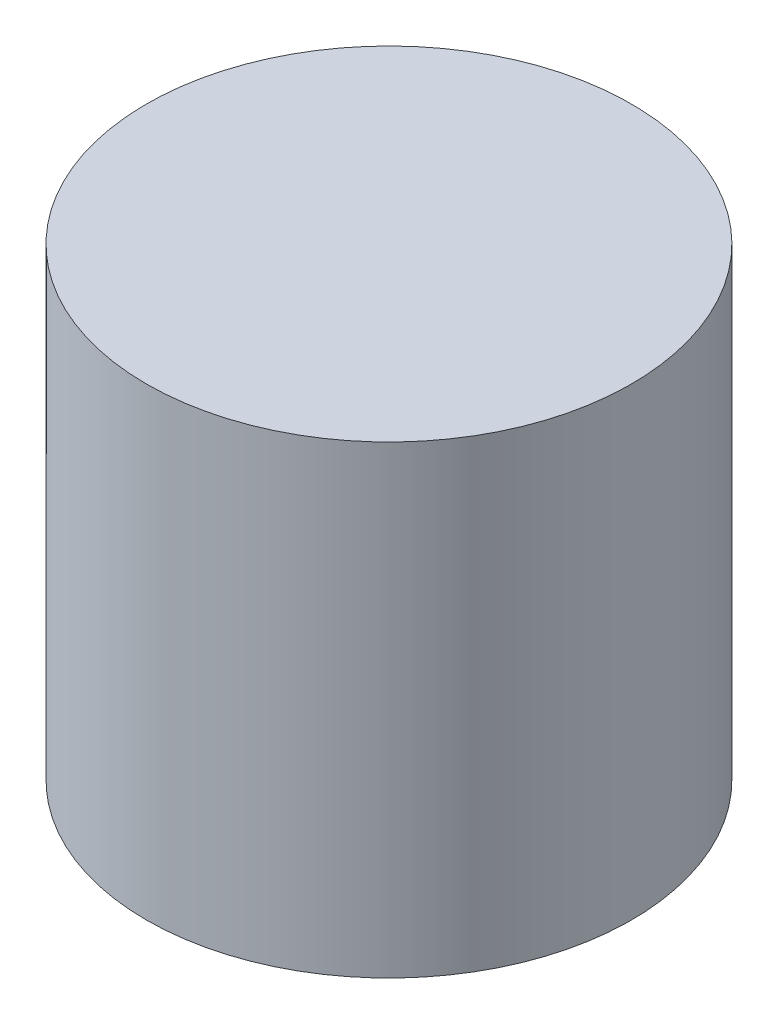
ISO-10303-21;
HEADER;
FILE_DESCRIPTION(('STEP AP214'),'2;1');
FILE_NAME('part.step','',(''),(''),'','','');
FILE_SCHEMA(('AUTOMOTIVE_DESIGN { 1 0 10303 214 1 1 1 1 }'));
ENDSEC;
DATA;
#1=APPLICATION_CONTEXT('core data for automotive mechanical design processes');
#2=APPLICATION_PROTOCOL_DEFINITION('international standard','automotive_design',2000,#1);
#3=PRODUCT_CONTEXT('',#1,'mechanical');
#4=PRODUCT('Part','Part','',(#3));
#5=PRODUCT_RELATED_PRODUCT_CATEGORY('part','',(#4));
#6=PRODUCT_DEFINITION_FORMATION('','',#4);
#7=PRODUCT_DEFINITION_CONTEXT('part definition',#1,'design');
#8=PRODUCT_DEFINITION('design','',#6,#7);
#9=PRODUCT_DEFINITION_SHAPE('','',#8);
#10=(LENGTH_UNIT() NAMED_UNIT(*) SI_UNIT(.MILLI.,.METRE.));
#11=(NAMED_UNIT(*) PLANE_ANGLE_UNIT() SI_UNIT($,.RADIAN.));
#12=(NAMED_UNIT(*) SI_UNIT($,.STERADIAN.) SOLID_ANGLE_UNIT());
#13=UNCERTAINTY_MEASURE_WITH_UNIT(LENGTH_MEASURE(1.E-05),#10,'distance_accuracy_value','');
#14=(GEOMETRIC_REPRESENTATION_CONTEXT(3) GLOBAL_UNCERTAINTY_ASSIGNED_CONTEXT((#13)) GLOBAL_UNIT_ASSIGNED_CONTEXT((#10,
#11,#12)) REPRESENTATION_CONTEXT('',''));
#15=CARTESIAN_POINT('',(0.,0.,0.));
#16=DIRECTION('',(0.,0.,1.));
#17=DIRECTION('',(1.,0.,0.));
#18=AXIS2_PLACEMENT_3D('',#15,#16,#17);
#19=CARTESIAN_POINT('',(0.,85.09,0.));
#20=DIRECTION('',(0.,-1.,0.));
#21=DIRECTION('',(0.,0.,-1.));
#22=AXIS2_PLACEMENT_3D('',#19,#20,#21);
#23=CYLINDRICAL_SURFACE('',#22,44.45);
#24=CARTESIAN_POINT('',(0.,85.09,0.));
#25=DIRECTION('',(0.,1.,0.));
#26=DIRECTION('',(0.,0.,1.));
#27=AXIS2_PLACEMENT_3D('',#24,#25,#26);
#28=CIRCLE('',#27,44.45);
#29=CARTESIAN_POINT('',(0.,85.09,44.45));
#30=VERTEX_POINT('',#29);
#31=EDGE_CURVE('E10',#30,#30,#28,.T.);
#32=ORIENTED_EDGE('',*,*,#31,.F.);
#33=EDGE_LOOP('',(#32));
#34=FACE_BOUND('',#33,.T.);
#35=CARTESIAN_POINT('',(0.,0.,0.));
#36=DIRECTION('',(0.,1.,0.));
#37=DIRECTION('',(0.,0.,1.));
#38=AXIS2_PLACEMENT_3D('',#35,#36,#37);
#39=CIRCLE('',#38,44.45);
#40=CARTESIAN_POINT('',(0.,0.,44.45));
#41=VERTEX_POINT('',#40);
#42=EDGE_CURVE('E35',#41,#41,#39,.T.);
#43=ORIENTED_EDGE('',*,*,#42,.T.);
#44=EDGE_LOOP('',(#43));
#45=FACE_BOUND('',#44,.T.);
#46=ADVANCED_FACE('F29',(#34,#45),#23,.T.);
#47=CARTESIAN_POINT('',(0.,85.09,0.));
#48=DIRECTION('',(0.,1.,0.));
#49=DIRECTION('',(0.,0.,1.));
#50=AXIS2_PLACEMENT_3D('',#47,#48,#49);
#51=PLANE('',#50);
#52=ORIENTED_EDGE('',*,*,#31,.T.);
#53=EDGE_LOOP('',(#52));
#54=FACE_BOUND('',#53,.T.);
#55=ADVANCED_FACE('F44',(#54),#51,.T.);
#56=CARTESIAN_POINT('',(0.,0.,0.));
#57=DIRECTION('',(0.,1.,0.));
#58=DIRECTION('',(0.,0.,1.));
#59=AXIS2_PLACEMENT_3D('',#56,#57,#58);
#60=PLANE('',#59);
#61=ORIENTED_EDGE('',*,*,#42,.F.);
#62=EDGE_LOOP('',(#61));
#63=FACE_BOUND('',#62,.T.);
#64=ADVANCED_FACE('F42',(#63),#60,.F.);
#65=CLOSED_SHELL('',(#46,#55,#64));
#66=MANIFOLD_SOLID_BREP('B2',#65);
#67=ADVANCED_BREP_SHAPE_REPRESENTATION('',(#18,#66),#14);
#68=SHAPE_DEFINITION_REPRESENTATION(#9,#67);
ENDSEC;
END-ISO-10303-21;
